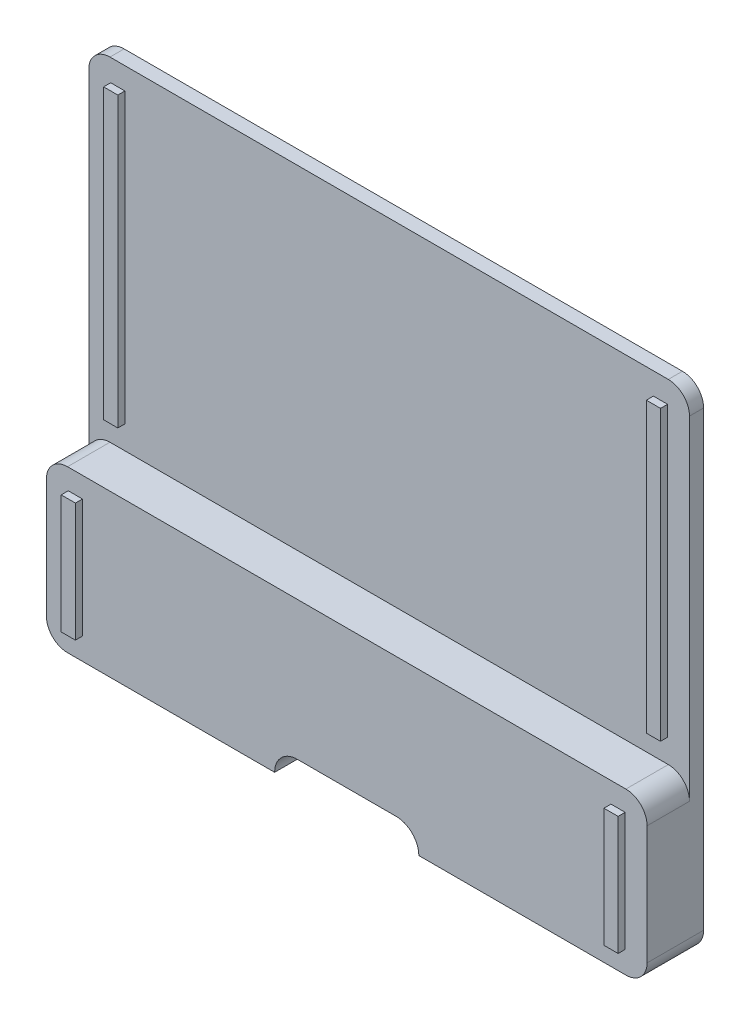
ISO-10303-21;
HEADER;
FILE_DESCRIPTION(('STEP AP214'),'2;1');
FILE_NAME('part.step','',(''),(''),'','','');
FILE_SCHEMA(('AUTOMOTIVE_DESIGN { 1 0 10303 214 1 1 1 1 }'));
ENDSEC;
DATA;
#1=APPLICATION_CONTEXT('core data for automotive mechanical design processes');
#2=APPLICATION_PROTOCOL_DEFINITION('international standard','automotive_design',2000,#1);
#3=PRODUCT_CONTEXT('',#1,'mechanical');
#4=PRODUCT('Part','Part','',(#3));
#5=PRODUCT_RELATED_PRODUCT_CATEGORY('part','',(#4));
#6=PRODUCT_DEFINITION_FORMATION('','',#4);
#7=PRODUCT_DEFINITION_CONTEXT('part definition',#1,'design');
#8=PRODUCT_DEFINITION('design','',#6,#7);
#9=PRODUCT_DEFINITION_SHAPE('','',#8);
#10=(LENGTH_UNIT() NAMED_UNIT(*) SI_UNIT(.MILLI.,.METRE.));
#11=(NAMED_UNIT(*) PLANE_ANGLE_UNIT() SI_UNIT($,.RADIAN.));
#12=(NAMED_UNIT(*) SI_UNIT($,.STERADIAN.) SOLID_ANGLE_UNIT());
#13=UNCERTAINTY_MEASURE_WITH_UNIT(LENGTH_MEASURE(1.E-05),#10,'distance_accuracy_value','');
#14=(GEOMETRIC_REPRESENTATION_CONTEXT(3) GLOBAL_UNCERTAINTY_ASSIGNED_CONTEXT((#13)) GLOBAL_UNIT_ASSIGNED_CONTEXT((#10,
#11,#12)) REPRESENTATION_CONTEXT('',''));
#15=CARTESIAN_POINT('',(0.,0.,0.));
#16=DIRECTION('',(0.,0.,1.));
#17=DIRECTION('',(1.,0.,0.));
#18=AXIS2_PLACEMENT_3D('',#15,#16,#17);
#19=CARTESIAN_POINT('',(82.0000000000004,66.9999999999988,2.));
#20=DIRECTION('',(0.,0.,-1.));
#21=DIRECTION('',(-1.,0.,0.));
#22=AXIS2_PLACEMENT_3D('',#19,#20,#21);
#23=PLANE('',#22);
#24=DIRECTION('',(0.,-1.,0.));
#25=VECTOR('',#24,1.);
#26=CARTESIAN_POINT('',(3.09999999999784,66.8999999999988,2.));
#27=LINE('',#26,#25);
#28=CARTESIAN_POINT('',(3.09999999999784,66.8999999999988,2.));
#29=VERTEX_POINT('',#28);
#30=CARTESIAN_POINT('',(3.09999999999784,26.0999999999973,2.));
#31=VERTEX_POINT('',#30);
#32=EDGE_CURVE('E274',#29,#31,#27,.T.);
#33=ORIENTED_EDGE('',*,*,#32,.F.);
#34=DIRECTION('',(-1.,0.,0.));
#35=VECTOR('',#34,1.);
#36=CARTESIAN_POINT('',(3.09999999999784,66.8999999999988,2.));
#37=LINE('',#36,#35);
#38=CARTESIAN_POINT('',(5.11,66.8999999999988,2.));
#39=VERTEX_POINT('',#38);
#40=EDGE_CURVE('E290',#39,#29,#37,.T.);
#41=ORIENTED_EDGE('',*,*,#40,.F.);
#42=DIRECTION('',(0.,1.,0.));
#43=VECTOR('',#42,1.);
#44=CARTESIAN_POINT('',(5.11,66.8999999999988,2.));
#45=LINE('',#44,#43);
#46=CARTESIAN_POINT('',(5.11,26.0999999999973,2.));
#47=VERTEX_POINT('',#46);
#48=EDGE_CURVE('E303',#47,#39,#45,.T.);
#49=ORIENTED_EDGE('',*,*,#48,.F.);
#50=DIRECTION('',(1.,0.,0.));
#51=VECTOR('',#50,1.);
#52=CARTESIAN_POINT('',(3.09999999999784,26.0999999999973,2.));
#53=LINE('',#52,#51);
#54=EDGE_CURVE('E279',#31,#47,#53,.T.);
#55=ORIENTED_EDGE('',*,*,#54,.F.);
#56=EDGE_LOOP('',(#33,#41,#49,#55));
#57=FACE_BOUND('',#56,.T.);
#58=CARTESIAN_POINT('',(82.0000000000007,66.9999999999988,2.));
#59=DIRECTION('',(0.,0.,-1.));
#60=DIRECTION('',(-1.,0.,0.));
#61=AXIS2_PLACEMENT_3D('',#58,#59,#60);
#62=CIRCLE('',#61,3.);
#63=CARTESIAN_POINT('',(85.0000000000007,66.9999999999988,2.));
#64=VERTEX_POINT('',#63);
#65=CARTESIAN_POINT('',(82.0000000000006,69.9999999999988,2.));
#66=VERTEX_POINT('',#65);
#67=EDGE_CURVE('E429',#64,#66,#62,.F.);
#68=ORIENTED_EDGE('',*,*,#67,.T.);
#69=DIRECTION('',(-1.,0.,0.));
#70=VECTOR('',#69,1.);
#71=CARTESIAN_POINT('',(3.00000000000062,69.9999999999988,2.));
#72=LINE('',#71,#70);
#73=CARTESIAN_POINT('',(3.00000000000062,69.9999999999988,2.));
#74=VERTEX_POINT('',#73);
#75=EDGE_CURVE('E419',#66,#74,#72,.T.);
#76=ORIENTED_EDGE('',*,*,#75,.T.);
#77=CARTESIAN_POINT('',(3.00000000000062,66.9999999999987,2.));
#78=DIRECTION('',(0.,0.,-1.));
#79=DIRECTION('',(-1.,0.,0.));
#80=AXIS2_PLACEMENT_3D('',#77,#78,#79);
#81=CIRCLE('',#80,3.00000000000008);
#82=CARTESIAN_POINT('',(5.39932681897781E-13,66.9999999999987,2.));
#83=VERTEX_POINT('',#82);
#84=EDGE_CURVE('E428',#74,#83,#81,.F.);
#85=ORIENTED_EDGE('',*,*,#84,.T.);
#86=DIRECTION('',(0.,-1.,0.));
#87=VECTOR('',#86,1.);
#88=CARTESIAN_POINT('',(5.42968447980741E-13,66.9999999999988,2.));
#89=LINE('',#88,#87);
#90=CARTESIAN_POINT('',(5.48748780872717E-13,19.7999999999962,2.));
#91=VERTEX_POINT('',#90);
#92=EDGE_CURVE('E452',#83,#91,#89,.T.);
#93=ORIENTED_EDGE('',*,*,#92,.T.);
#94=CARTESIAN_POINT('',(2.99999999999875,19.7999999999989,2.));
#95=DIRECTION('',(0.,0.,-1.));
#96=DIRECTION('',(-1.,0.,0.));
#97=AXIS2_PLACEMENT_3D('',#94,#95,#96);
#98=CIRCLE('',#97,2.9999999999984);
#99=CARTESIAN_POINT('',(2.99999999999875,22.7999999999973,2.));
#100=VERTEX_POINT('',#99);
#101=EDGE_CURVE('E447',#91,#100,#98,.T.);
#102=ORIENTED_EDGE('',*,*,#101,.T.);
#103=DIRECTION('',(1.,0.,0.));
#104=VECTOR('',#103,1.);
#105=CARTESIAN_POINT('',(2.99999999999875,22.7999999999974,2.));
#106=LINE('',#105,#104);
#107=CARTESIAN_POINT('',(81.9999999999994,22.7999999999974,2.));
#108=VERTEX_POINT('',#107);
#109=EDGE_CURVE('E442',#100,#108,#106,.T.);
#110=ORIENTED_EDGE('',*,*,#109,.T.);
#111=CARTESIAN_POINT('',(81.9999999999994,19.7999999999962,2.));
#112=DIRECTION('',(0.,0.,-1.));
#113=DIRECTION('',(-1.,0.,0.));
#114=AXIS2_PLACEMENT_3D('',#111,#112,#113);
#115=CIRCLE('',#114,3.00000000000124);
#116=CARTESIAN_POINT('',(85.0000000000007,19.7999999999962,2.));
#117=VERTEX_POINT('',#116);
#118=EDGE_CURVE('E437',#108,#117,#115,.T.);
#119=ORIENTED_EDGE('',*,*,#118,.T.);
#120=DIRECTION('',(0.,1.,0.));
#121=VECTOR('',#120,1.);
#122=CARTESIAN_POINT('',(85.0000000000007,66.9999999999988,2.));
#123=LINE('',#122,#121);
#124=EDGE_CURVE('E433',#117,#64,#123,.T.);
#125=ORIENTED_EDGE('',*,*,#124,.T.);
#126=EDGE_LOOP('',(#68,#76,#85,#93,#102,#110,#119,#125));
#127=FACE_BOUND('',#126,.T.);
#128=DIRECTION('',(0.,1.,0.));
#129=VECTOR('',#128,1.);
#130=CARTESIAN_POINT('',(81.9000000000007,66.8999999999988,2.));
#131=LINE('',#130,#129);
#132=CARTESIAN_POINT('',(81.9000000000007,26.0999999999973,2.));
#133=VERTEX_POINT('',#132);
#134=CARTESIAN_POINT('',(81.9000000000007,66.8999999999988,2.));
#135=VERTEX_POINT('',#134);
#136=EDGE_CURVE('E272',#133,#135,#131,.T.);
#137=ORIENTED_EDGE('',*,*,#136,.F.);
#138=DIRECTION('',(1.,0.,0.));
#139=VECTOR('',#138,1.);
#140=CARTESIAN_POINT('',(81.9000000000007,26.0999999999973,2.));
#141=LINE('',#140,#139);
#142=CARTESIAN_POINT('',(79.8900000000007,26.0999999999973,2.));
#143=VERTEX_POINT('',#142);
#144=EDGE_CURVE('E269',#143,#133,#141,.T.);
#145=ORIENTED_EDGE('',*,*,#144,.F.);
#146=DIRECTION('',(0.,-1.,0.));
#147=VECTOR('',#146,1.);
#148=CARTESIAN_POINT('',(79.8900000000007,66.8999999999988,2.));
#149=LINE('',#148,#147);
#150=CARTESIAN_POINT('',(79.8900000000007,66.8999999999988,2.));
#151=VERTEX_POINT('',#150);
#152=EDGE_CURVE('E62',#151,#143,#149,.T.);
#153=ORIENTED_EDGE('',*,*,#152,.F.);
#154=DIRECTION('',(-1.,0.,0.));
#155=VECTOR('',#154,1.);
#156=CARTESIAN_POINT('',(81.9000000000007,66.8999999999988,2.));
#157=LINE('',#156,#155);
#158=EDGE_CURVE('E57',#135,#151,#157,.T.);
#159=ORIENTED_EDGE('',*,*,#158,.F.);
#160=EDGE_LOOP('',(#137,#145,#153,#159));
#161=FACE_BOUND('',#160,.T.);
#162=ADVANCED_FACE('F41',(#57,#127,#161),#23,.F.);
#163=CARTESIAN_POINT('',(82.0000000000004,66.9999999999988,8.));
#164=DIRECTION('',(0.,0.,-1.));
#165=DIRECTION('',(-1.,0.,0.));
#166=AXIS2_PLACEMENT_3D('',#163,#164,#165);
#167=PLANE('',#166);
#168=DIRECTION('',(0.,-1.,0.));
#169=VECTOR('',#168,1.);
#170=CARTESIAN_POINT('',(3.1,3.1,8.));
#171=LINE('',#170,#169);
#172=CARTESIAN_POINT('',(3.1,19.8999999999989,8.));
#173=VERTEX_POINT('',#172);
#174=CARTESIAN_POINT('',(3.10000000000001,3.10000000000001,8.));
#175=VERTEX_POINT('',#174);
#176=EDGE_CURVE('E370',#173,#175,#171,.T.);
#177=ORIENTED_EDGE('',*,*,#176,.F.);
#178=DIRECTION('',(-1.,0.,0.));
#179=VECTOR('',#178,1.);
#180=CARTESIAN_POINT('',(3.1,19.8999999999989,8.));
#181=LINE('',#180,#179);
#182=CARTESIAN_POINT('',(5.11,19.8999999999989,8.));
#183=VERTEX_POINT('',#182);
#184=EDGE_CURVE('E376',#183,#173,#181,.T.);
#185=ORIENTED_EDGE('',*,*,#184,.F.);
#186=DIRECTION('',(0.,1.,0.));
#187=VECTOR('',#186,1.);
#188=CARTESIAN_POINT('',(5.11,3.1,8.));
#189=LINE('',#188,#187);
#190=CARTESIAN_POINT('',(5.11,3.10000000000001,8.));
#191=VERTEX_POINT('',#190);
#192=EDGE_CURVE('E393',#191,#183,#189,.T.);
#193=ORIENTED_EDGE('',*,*,#192,.F.);
#194=DIRECTION('',(1.,0.,0.));
#195=VECTOR('',#194,1.);
#196=CARTESIAN_POINT('',(3.1,3.1,8.));
#197=LINE('',#196,#195);
#198=EDGE_CURVE('E389',#175,#191,#197,.T.);
#199=ORIENTED_EDGE('',*,*,#198,.F.);
#200=EDGE_LOOP('',(#177,#185,#193,#199));
#201=FACE_BOUND('',#200,.T.);
#202=DIRECTION('',(1.,0.,0.));
#203=VECTOR('',#202,1.);
#204=CARTESIAN_POINT('',(2.99999999999875,22.7999999999974,8.));
#205=LINE('',#204,#203);
#206=CARTESIAN_POINT('',(2.99999999999875,22.7999999999973,8.));
#207=VERTEX_POINT('',#206);
#208=CARTESIAN_POINT('',(81.9999999999994,22.7999999999974,8.00000000000001));
#209=VERTEX_POINT('',#208);
#210=EDGE_CURVE('E420',#207,#209,#205,.T.);
#211=ORIENTED_EDGE('',*,*,#210,.F.);
#212=CARTESIAN_POINT('',(2.99999999999875,19.7999999999989,8.));
#213=DIRECTION('',(0.,0.,-1.));
#214=DIRECTION('',(1.,0.,0.));
#215=AXIS2_PLACEMENT_3D('',#212,#213,#214);
#216=CIRCLE('',#215,2.9999999999984);
#217=CARTESIAN_POINT('',(5.48748780872717E-13,19.7999999999962,8.));
#218=VERTEX_POINT('',#217);
#219=EDGE_CURVE('E415',#218,#207,#216,.T.);
#220=ORIENTED_EDGE('',*,*,#219,.F.);
#221=DIRECTION('',(0.,-1.,0.));
#222=VECTOR('',#221,1.);
#223=CARTESIAN_POINT('',(0.,66.9999999999988,8.));
#224=LINE('',#223,#222);
#225=CARTESIAN_POINT('',(0.,3.00000000000001,8.));
#226=VERTEX_POINT('',#225);
#227=EDGE_CURVE('E468',#218,#226,#224,.T.);
#228=ORIENTED_EDGE('',*,*,#227,.T.);
#229=CARTESIAN_POINT('',(3.00000000000001,3.00000000000001,8.));
#230=DIRECTION('',(0.,0.,1.));
#231=DIRECTION('',(1.,0.,0.));
#232=AXIS2_PLACEMENT_3D('',#229,#230,#231);
#233=CIRCLE('',#232,3.00000000000001);
#234=CARTESIAN_POINT('',(3.00000000000001,0.,8.));
#235=VERTEX_POINT('',#234);
#236=EDGE_CURVE('E471',#226,#235,#233,.T.);
#237=ORIENTED_EDGE('',*,*,#236,.T.);
#238=DIRECTION('',(1.,0.,0.));
#239=VECTOR('',#238,1.);
#240=CARTESIAN_POINT('',(3.00000000000001,0.,8.));
#241=LINE('',#240,#239);
#242=CARTESIAN_POINT('',(32.3000000000006,0.,8.));
#243=VERTEX_POINT('',#242);
#244=EDGE_CURVE('E475',#235,#243,#241,.T.);
#245=ORIENTED_EDGE('',*,*,#244,.T.);
#246=CARTESIAN_POINT('',(35.5000000000006,0.,8.));
#247=DIRECTION('',(0.,0.,-1.));
#248=DIRECTION('',(1.,0.,0.));
#249=AXIS2_PLACEMENT_3D('',#246,#247,#248);
#250=CIRCLE('',#249,3.20000000000001);
#251=CARTESIAN_POINT('',(35.5000000000006,3.20000000000001,8.));
#252=VERTEX_POINT('',#251);
#253=EDGE_CURVE('E478',#243,#252,#250,.T.);
#254=ORIENTED_EDGE('',*,*,#253,.T.);
#255=DIRECTION('',(1.,0.,0.));
#256=VECTOR('',#255,1.);
#257=CARTESIAN_POINT('',(35.5000000000006,3.20000000000001,8.));
#258=LINE('',#257,#256);
#259=CARTESIAN_POINT('',(49.5000000000006,3.20000000000001,8.));
#260=VERTEX_POINT('',#259);
#261=EDGE_CURVE('E481',#252,#260,#258,.T.);
#262=ORIENTED_EDGE('',*,*,#261,.T.);
#263=CARTESIAN_POINT('',(49.5000000000006,0.,8.));
#264=DIRECTION('',(0.,0.,-1.));
#265=DIRECTION('',(1.,0.,0.));
#266=AXIS2_PLACEMENT_3D('',#263,#264,#265);
#267=CIRCLE('',#266,3.20000000000001);
#268=CARTESIAN_POINT('',(52.7000000000006,0.,8.));
#269=VERTEX_POINT('',#268);
#270=EDGE_CURVE('E484',#260,#269,#267,.T.);
#271=ORIENTED_EDGE('',*,*,#270,.T.);
#272=DIRECTION('',(1.,0.,0.));
#273=VECTOR('',#272,1.);
#274=CARTESIAN_POINT('',(52.7000000000006,0.,8.));
#275=LINE('',#274,#273);
#276=CARTESIAN_POINT('',(82.0000000000007,0.,8.));
#277=VERTEX_POINT('',#276);
#278=EDGE_CURVE('E487',#269,#277,#275,.T.);
#279=ORIENTED_EDGE('',*,*,#278,.T.);
#280=CARTESIAN_POINT('',(82.0000000000007,3.00000000000001,8.));
#281=DIRECTION('',(0.,0.,1.));
#282=DIRECTION('',(1.,0.,0.));
#283=AXIS2_PLACEMENT_3D('',#280,#281,#282);
#284=CIRCLE('',#283,3.);
#285=CARTESIAN_POINT('',(85.0000000000007,3.00000000000001,8.));
#286=VERTEX_POINT('',#285);
#287=EDGE_CURVE('E490',#277,#286,#284,.T.);
#288=ORIENTED_EDGE('',*,*,#287,.T.);
#289=DIRECTION('',(0.,1.,0.));
#290=VECTOR('',#289,1.);
#291=CARTESIAN_POINT('',(85.0000000000004,66.9999999999988,8.));
#292=LINE('',#291,#290);
#293=CARTESIAN_POINT('',(85.0000000000007,19.7999999999962,8.));
#294=VERTEX_POINT('',#293);
#295=EDGE_CURVE('E493',#286,#294,#292,.T.);
#296=ORIENTED_EDGE('',*,*,#295,.T.);
#297=CARTESIAN_POINT('',(81.9999999999994,19.7999999999962,8.));
#298=DIRECTION('',(0.,0.,-1.));
#299=DIRECTION('',(1.,0.,0.));
#300=AXIS2_PLACEMENT_3D('',#297,#298,#299);
#301=CIRCLE('',#300,3.00000000000124);
#302=EDGE_CURVE('E416',#209,#294,#301,.T.);
#303=ORIENTED_EDGE('',*,*,#302,.F.);
#304=EDGE_LOOP('',(#211,#220,#228,#237,#245,#254,#262,#271,#279,#288,#296,#303));
#305=FACE_BOUND('',#304,.T.);
#306=DIRECTION('',(0.,1.,0.));
#307=VECTOR('',#306,1.);
#308=CARTESIAN_POINT('',(81.9000000000007,3.1,8.));
#309=LINE('',#308,#307);
#310=CARTESIAN_POINT('',(81.9000000000007,3.1,8.));
#311=VERTEX_POINT('',#310);
#312=CARTESIAN_POINT('',(81.9000000000007,19.8999999999989,8.));
#313=VERTEX_POINT('',#312);
#314=EDGE_CURVE('E325',#311,#313,#309,.T.);
#315=ORIENTED_EDGE('',*,*,#314,.F.);
#316=DIRECTION('',(1.,0.,0.));
#317=VECTOR('',#316,1.);
#318=CARTESIAN_POINT('',(81.9000000000007,3.1,8.));
#319=LINE('',#318,#317);
#320=CARTESIAN_POINT('',(79.8900000000007,3.1,8.));
#321=VERTEX_POINT('',#320);
#322=EDGE_CURVE('E331',#321,#311,#319,.T.);
#323=ORIENTED_EDGE('',*,*,#322,.F.);
#324=DIRECTION('',(0.,-1.,0.));
#325=VECTOR('',#324,1.);
#326=CARTESIAN_POINT('',(79.8900000000007,3.1,8.));
#327=LINE('',#326,#325);
#328=CARTESIAN_POINT('',(79.8900000000007,19.8999999999989,8.));
#329=VERTEX_POINT('',#328);
#330=EDGE_CURVE('E348',#329,#321,#327,.T.);
#331=ORIENTED_EDGE('',*,*,#330,.F.);
#332=DIRECTION('',(-1.,0.,0.));
#333=VECTOR('',#332,1.);
#334=CARTESIAN_POINT('',(81.9000000000007,19.8999999999989,8.));
#335=LINE('',#334,#333);
#336=EDGE_CURVE('E344',#313,#329,#335,.T.);
#337=ORIENTED_EDGE('',*,*,#336,.F.);
#338=EDGE_LOOP('',(#315,#323,#331,#337));
#339=FACE_BOUND('',#338,.T.);
#340=ADVANCED_FACE('F603',(#201,#305,#339),#167,.F.);
#341=CARTESIAN_POINT('',(82.0000000000004,66.9999999999988,8.));
#342=DIRECTION('',(0.,0.,-1.));
#343=DIRECTION('',(-1.,0.,0.));
#344=AXIS2_PLACEMENT_3D('',#341,#342,#343);
#345=CYLINDRICAL_SURFACE('',#344,3.);
#346=DIRECTION('',(0.,0.,-1.));
#347=VECTOR('',#346,1.);
#348=CARTESIAN_POINT('',(81.9999999999991,69.9999999999988,8.));
#349=LINE('',#348,#347);
#350=CARTESIAN_POINT('',(81.9999999999991,69.9999999999988,0.));
#351=VERTEX_POINT('',#350);
#352=EDGE_CURVE('E12',#66,#351,#349,.T.);
#353=ORIENTED_EDGE('',*,*,#352,.F.);
#354=ORIENTED_EDGE('',*,*,#67,.F.);
#355=DIRECTION('',(0.,0.,-1.));
#356=VECTOR('',#355,1.);
#357=CARTESIAN_POINT('',(85.0000000000004,66.9999999999988,8.));
#358=LINE('',#357,#356);
#359=CARTESIAN_POINT('',(85.0000000000004,66.9999999999988,0.));
#360=VERTEX_POINT('',#359);
#361=EDGE_CURVE('E497',#64,#360,#358,.T.);
#362=ORIENTED_EDGE('',*,*,#361,.T.);
#363=CARTESIAN_POINT('',(82.0000000000004,66.9999999999988,0.));
#364=DIRECTION('',(0.,0.,1.));
#365=DIRECTION('',(-1.,0.,0.));
#366=AXIS2_PLACEMENT_3D('',#363,#364,#365);
#367=CIRCLE('',#366,3.);
#368=EDGE_CURVE('E432',#360,#351,#367,.T.);
#369=ORIENTED_EDGE('',*,*,#368,.T.);
#370=EDGE_LOOP('',(#353,#354,#362,#369));
#371=FACE_BOUND('',#370,.T.);
#372=ADVANCED_FACE('F43',(#371),#345,.T.);
#373=CARTESIAN_POINT('',(2.99999999999913,69.9999999999988,8.));
#374=DIRECTION('',(0.,-1.,0.));
#375=DIRECTION('',(0.,0.,-1.));
#376=AXIS2_PLACEMENT_3D('',#373,#374,#375);
#377=PLANE('',#376);
#378=DIRECTION('',(0.,0.,-1.));
#379=VECTOR('',#378,1.);
#380=CARTESIAN_POINT('',(2.99999999999913,69.9999999999988,8.));
#381=LINE('',#380,#379);
#382=CARTESIAN_POINT('',(2.99999999999913,69.9999999999988,0.));
#383=VERTEX_POINT('',#382);
#384=EDGE_CURVE('E50',#74,#383,#381,.T.);
#385=ORIENTED_EDGE('',*,*,#384,.F.);
#386=ORIENTED_EDGE('',*,*,#75,.F.);
#387=ORIENTED_EDGE('',*,*,#352,.T.);
#388=DIRECTION('',(-1.,0.,0.));
#389=VECTOR('',#388,1.);
#390=CARTESIAN_POINT('',(2.99999999999913,69.9999999999988,0.));
#391=LINE('',#390,#389);
#392=EDGE_CURVE('E501',#351,#383,#391,.T.);
#393=ORIENTED_EDGE('',*,*,#392,.T.);
#394=EDGE_LOOP('',(#385,#386,#387,#393));
#395=FACE_BOUND('',#394,.T.);
#396=ADVANCED_FACE('F583',(#395),#377,.F.);
#397=CARTESIAN_POINT('',(3.00000000000032,66.9999999999988,8.));
#398=DIRECTION('',(0.,0.,-1.));
#399=DIRECTION('',(-1.,0.,0.));
#400=AXIS2_PLACEMENT_3D('',#397,#398,#399);
#401=CYLINDRICAL_SURFACE('',#400,3.00000000000016);
#402=DIRECTION('',(0.,0.,-1.));
#403=VECTOR('',#402,1.);
#404=CARTESIAN_POINT('',(1.58727198051878E-13,66.9999999999988,8.));
#405=LINE('',#404,#403);
#406=CARTESIAN_POINT('',(1.58727198051878E-13,66.9999999999988,0.));
#407=VERTEX_POINT('',#406);
#408=EDGE_CURVE('E570',#83,#407,#405,.T.);
#409=ORIENTED_EDGE('',*,*,#408,.F.);
#410=ORIENTED_EDGE('',*,*,#84,.F.);
#411=ORIENTED_EDGE('',*,*,#384,.T.);
#412=CARTESIAN_POINT('',(3.00000000000032,66.9999999999988,0.));
#413=DIRECTION('',(0.,0.,1.));
#414=DIRECTION('',(-1.,0.,0.));
#415=AXIS2_PLACEMENT_3D('',#412,#413,#414);
#416=CIRCLE('',#415,3.00000000000016);
#417=EDGE_CURVE('E505',#383,#407,#416,.T.);
#418=ORIENTED_EDGE('',*,*,#417,.T.);
#419=EDGE_LOOP('',(#409,#410,#411,#418));
#420=FACE_BOUND('',#419,.T.);
#421=ADVANCED_FACE('F577',(#420),#401,.T.);
#422=CARTESIAN_POINT('',(0.,66.9999999999988,8.));
#423=DIRECTION('',(1.,0.,0.));
#424=DIRECTION('',(0.,0.,-1.));
#425=AXIS2_PLACEMENT_3D('',#422,#423,#424);
#426=PLANE('',#425);
#427=DIRECTION('',(0.,0.,1.));
#428=VECTOR('',#427,1.);
#429=CARTESIAN_POINT('',(5.48748780872717E-13,19.7999999999962,-98.7169691593108));
#430=LINE('',#429,#428);
#431=EDGE_CURVE('E451',#91,#218,#430,.T.);
#432=ORIENTED_EDGE('',*,*,#431,.F.);
#433=ORIENTED_EDGE('',*,*,#92,.F.);
#434=ORIENTED_EDGE('',*,*,#408,.T.);
#435=DIRECTION('',(0.,-1.,0.));
#436=VECTOR('',#435,1.);
#437=CARTESIAN_POINT('',(0.,66.9999999999988,0.));
#438=LINE('',#437,#436);
#439=CARTESIAN_POINT('',(0.,3.00000000000001,0.));
#440=VERTEX_POINT('',#439);
#441=EDGE_CURVE('E509',#407,#440,#438,.T.);
#442=ORIENTED_EDGE('',*,*,#441,.T.);
#443=DIRECTION('',(0.,0.,-1.));
#444=VECTOR('',#443,1.);
#445=CARTESIAN_POINT('',(0.,3.00000000000001,8.));
#446=LINE('',#445,#444);
#447=EDGE_CURVE('E566',#226,#440,#446,.T.);
#448=ORIENTED_EDGE('',*,*,#447,.F.);
#449=ORIENTED_EDGE('',*,*,#227,.F.);
#450=EDGE_LOOP('',(#432,#433,#434,#442,#448,#449));
#451=FACE_BOUND('',#450,.T.);
#452=ADVANCED_FACE('F593',(#451),#426,.F.);
#453=CARTESIAN_POINT('',(3.00000000000001,3.00000000000001,8.));
#454=DIRECTION('',(0.,0.,-1.));
#455=DIRECTION('',(-1.,0.,0.));
#456=AXIS2_PLACEMENT_3D('',#453,#454,#455);
#457=CYLINDRICAL_SURFACE('',#456,3.00000000000001);
#458=CARTESIAN_POINT('',(3.00000000000001,3.00000000000001,0.));
#459=DIRECTION('',(0.,0.,1.));
#460=DIRECTION('',(1.,0.,0.));
#461=AXIS2_PLACEMENT_3D('',#458,#459,#460);
#462=CIRCLE('',#461,3.00000000000001);
#463=CARTESIAN_POINT('',(3.00000000000001,0.,0.));
#464=VERTEX_POINT('',#463);
#465=EDGE_CURVE('E512',#440,#464,#462,.T.);
#466=ORIENTED_EDGE('',*,*,#465,.T.);
#467=DIRECTION('',(0.,0.,-1.));
#468=VECTOR('',#467,1.);
#469=CARTESIAN_POINT('',(3.00000000000001,0.,8.));
#470=LINE('',#469,#468);
#471=EDGE_CURVE('E562',#235,#464,#470,.T.);
#472=ORIENTED_EDGE('',*,*,#471,.F.);
#473=ORIENTED_EDGE('',*,*,#236,.F.);
#474=ORIENTED_EDGE('',*,*,#447,.T.);
#475=EDGE_LOOP('',(#466,#472,#473,#474));
#476=FACE_BOUND('',#475,.T.);
#477=ADVANCED_FACE('F598',(#476),#457,.T.);
#478=CARTESIAN_POINT('',(3.00000000000001,0.,8.));
#479=DIRECTION('',(0.,1.,0.));
#480=DIRECTION('',(0.,0.,1.));
#481=AXIS2_PLACEMENT_3D('',#478,#479,#480);
#482=PLANE('',#481);
#483=DIRECTION('',(1.,0.,0.));
#484=VECTOR('',#483,1.);
#485=CARTESIAN_POINT('',(3.00000000000001,0.,0.));
#486=LINE('',#485,#484);
#487=CARTESIAN_POINT('',(32.3000000000006,0.,0.));
#488=VERTEX_POINT('',#487);
#489=EDGE_CURVE('E515',#464,#488,#486,.T.);
#490=ORIENTED_EDGE('',*,*,#489,.T.);
#491=DIRECTION('',(0.,0.,-1.));
#492=VECTOR('',#491,1.);
#493=CARTESIAN_POINT('',(32.3000000000006,0.,8.));
#494=LINE('',#493,#492);
#495=EDGE_CURVE('E558',#243,#488,#494,.T.);
#496=ORIENTED_EDGE('',*,*,#495,.F.);
#497=ORIENTED_EDGE('',*,*,#244,.F.);
#498=ORIENTED_EDGE('',*,*,#471,.T.);
#499=EDGE_LOOP('',(#490,#496,#497,#498));
#500=FACE_BOUND('',#499,.T.);
#501=ADVANCED_FACE('F645',(#500),#482,.F.);
#502=CARTESIAN_POINT('',(35.5000000000006,0.,8.));
#503=DIRECTION('',(0.,0.,-1.));
#504=DIRECTION('',(-1.,0.,0.));
#505=AXIS2_PLACEMENT_3D('',#502,#503,#504);
#506=CYLINDRICAL_SURFACE('',#505,3.20000000000001);
#507=CARTESIAN_POINT('',(35.5000000000006,0.,0.));
#508=DIRECTION('',(0.,0.,-1.));
#509=DIRECTION('',(1.,0.,0.));
#510=AXIS2_PLACEMENT_3D('',#507,#508,#509);
#511=CIRCLE('',#510,3.20000000000001);
#512=CARTESIAN_POINT('',(35.5000000000006,3.20000000000001,0.));
#513=VERTEX_POINT('',#512);
#514=EDGE_CURVE('E518',#488,#513,#511,.T.);
#515=ORIENTED_EDGE('',*,*,#514,.T.);
#516=DIRECTION('',(0.,0.,-1.));
#517=VECTOR('',#516,1.);
#518=CARTESIAN_POINT('',(35.5000000000006,3.20000000000001,8.));
#519=LINE('',#518,#517);
#520=EDGE_CURVE('E554',#252,#513,#519,.T.);
#521=ORIENTED_EDGE('',*,*,#520,.F.);
#522=ORIENTED_EDGE('',*,*,#253,.F.);
#523=ORIENTED_EDGE('',*,*,#495,.T.);
#524=EDGE_LOOP('',(#515,#521,#522,#523));
#525=FACE_BOUND('',#524,.T.);
#526=ADVANCED_FACE('F643',(#525),#506,.F.);
#527=CARTESIAN_POINT('',(35.5000000000006,3.20000000000001,8.));
#528=DIRECTION('',(0.,1.,0.));
#529=DIRECTION('',(0.,0.,1.));
#530=AXIS2_PLACEMENT_3D('',#527,#528,#529);
#531=PLANE('',#530);
#532=DIRECTION('',(1.,0.,0.));
#533=VECTOR('',#532,1.);
#534=CARTESIAN_POINT('',(35.5000000000006,3.20000000000001,0.));
#535=LINE('',#534,#533);
#536=CARTESIAN_POINT('',(49.5000000000006,3.20000000000001,0.));
#537=VERTEX_POINT('',#536);
#538=EDGE_CURVE('E521',#513,#537,#535,.T.);
#539=ORIENTED_EDGE('',*,*,#538,.T.);
#540=DIRECTION('',(0.,0.,-1.));
#541=VECTOR('',#540,1.);
#542=CARTESIAN_POINT('',(49.5000000000006,3.20000000000001,8.));
#543=LINE('',#542,#541);
#544=EDGE_CURVE('E550',#260,#537,#543,.T.);
#545=ORIENTED_EDGE('',*,*,#544,.F.);
#546=ORIENTED_EDGE('',*,*,#261,.F.);
#547=ORIENTED_EDGE('',*,*,#520,.T.);
#548=EDGE_LOOP('',(#539,#545,#546,#547));
#549=FACE_BOUND('',#548,.T.);
#550=ADVANCED_FACE('F639',(#549),#531,.F.);
#551=CARTESIAN_POINT('',(49.5000000000006,0.,8.));
#552=DIRECTION('',(0.,0.,-1.));
#553=DIRECTION('',(-1.,0.,0.));
#554=AXIS2_PLACEMENT_3D('',#551,#552,#553);
#555=CYLINDRICAL_SURFACE('',#554,3.20000000000001);
#556=CARTESIAN_POINT('',(49.5000000000006,0.,0.));
#557=DIRECTION('',(0.,0.,-1.));
#558=DIRECTION('',(1.,0.,0.));
#559=AXIS2_PLACEMENT_3D('',#556,#557,#558);
#560=CIRCLE('',#559,3.20000000000001);
#561=CARTESIAN_POINT('',(52.7000000000006,0.,0.));
#562=VERTEX_POINT('',#561);
#563=EDGE_CURVE('E524',#537,#562,#560,.T.);
#564=ORIENTED_EDGE('',*,*,#563,.T.);
#565=DIRECTION('',(0.,0.,-1.));
#566=VECTOR('',#565,1.);
#567=CARTESIAN_POINT('',(52.7000000000006,0.,8.));
#568=LINE('',#567,#566);
#569=EDGE_CURVE('E546',#269,#562,#568,.T.);
#570=ORIENTED_EDGE('',*,*,#569,.F.);
#571=ORIENTED_EDGE('',*,*,#270,.F.);
#572=ORIENTED_EDGE('',*,*,#544,.T.);
#573=EDGE_LOOP('',(#564,#570,#571,#572));
#574=FACE_BOUND('',#573,.T.);
#575=ADVANCED_FACE('F634',(#574),#555,.F.);
#576=CARTESIAN_POINT('',(52.7000000000006,0.,8.));
#577=DIRECTION('',(0.,1.,0.));
#578=DIRECTION('',(0.,0.,1.));
#579=AXIS2_PLACEMENT_3D('',#576,#577,#578);
#580=PLANE('',#579);
#581=DIRECTION('',(1.,0.,0.));
#582=VECTOR('',#581,1.);
#583=CARTESIAN_POINT('',(52.7000000000006,0.,0.));
#584=LINE('',#583,#582);
#585=CARTESIAN_POINT('',(82.0000000000007,0.,0.));
#586=VERTEX_POINT('',#585);
#587=EDGE_CURVE('E527',#562,#586,#584,.T.);
#588=ORIENTED_EDGE('',*,*,#587,.T.);
#589=DIRECTION('',(0.,0.,-1.));
#590=VECTOR('',#589,1.);
#591=CARTESIAN_POINT('',(82.0000000000007,0.,8.));
#592=LINE('',#591,#590);
#593=EDGE_CURVE('E542',#277,#586,#592,.T.);
#594=ORIENTED_EDGE('',*,*,#593,.F.);
#595=ORIENTED_EDGE('',*,*,#278,.F.);
#596=ORIENTED_EDGE('',*,*,#569,.T.);
#597=EDGE_LOOP('',(#588,#594,#595,#596));
#598=FACE_BOUND('',#597,.T.);
#599=ADVANCED_FACE('F628',(#598),#580,.F.);
#600=CARTESIAN_POINT('',(82.0000000000007,3.00000000000001,8.));
#601=DIRECTION('',(0.,0.,-1.));
#602=DIRECTION('',(-1.,0.,0.));
#603=AXIS2_PLACEMENT_3D('',#600,#601,#602);
#604=CYLINDRICAL_SURFACE('',#603,3.);
#605=CARTESIAN_POINT('',(82.0000000000007,3.00000000000001,0.));
#606=DIRECTION('',(0.,0.,1.));
#607=DIRECTION('',(1.,0.,0.));
#608=AXIS2_PLACEMENT_3D('',#605,#606,#607);
#609=CIRCLE('',#608,3.);
#610=CARTESIAN_POINT('',(85.0000000000007,3.00000000000001,0.));
#611=VERTEX_POINT('',#610);
#612=EDGE_CURVE('E530',#586,#611,#609,.T.);
#613=ORIENTED_EDGE('',*,*,#612,.T.);
#614=DIRECTION('',(0.,0.,-1.));
#615=VECTOR('',#614,1.);
#616=CARTESIAN_POINT('',(85.0000000000007,3.00000000000001,8.));
#617=LINE('',#616,#615);
#618=EDGE_CURVE('E538',#286,#611,#617,.T.);
#619=ORIENTED_EDGE('',*,*,#618,.F.);
#620=ORIENTED_EDGE('',*,*,#287,.F.);
#621=ORIENTED_EDGE('',*,*,#593,.T.);
#622=EDGE_LOOP('',(#613,#619,#620,#621));
#623=FACE_BOUND('',#622,.T.);
#624=ADVANCED_FACE('F624',(#623),#604,.T.);
#625=CARTESIAN_POINT('',(85.0000000000004,66.9999999999988,8.));
#626=DIRECTION('',(-1.,0.,0.));
#627=DIRECTION('',(0.,-1.,0.));
#628=AXIS2_PLACEMENT_3D('',#625,#626,#627);
#629=PLANE('',#628);
#630=ORIENTED_EDGE('',*,*,#361,.F.);
#631=ORIENTED_EDGE('',*,*,#124,.F.);
#632=DIRECTION('',(0.,0.,1.));
#633=VECTOR('',#632,1.);
#634=CARTESIAN_POINT('',(85.0000000000007,19.7999999999962,-98.7169691593108));
#635=LINE('',#634,#633);
#636=EDGE_CURVE('E436',#117,#294,#635,.T.);
#637=ORIENTED_EDGE('',*,*,#636,.T.);
#638=ORIENTED_EDGE('',*,*,#295,.F.);
#639=ORIENTED_EDGE('',*,*,#618,.T.);
#640=DIRECTION('',(0.,1.,0.));
#641=VECTOR('',#640,1.);
#642=CARTESIAN_POINT('',(85.0000000000004,66.9999999999988,0.));
#643=LINE('',#642,#641);
#644=EDGE_CURVE('E472',#611,#360,#643,.T.);
#645=ORIENTED_EDGE('',*,*,#644,.T.);
#646=EDGE_LOOP('',(#630,#631,#637,#638,#639,#645));
#647=FACE_BOUND('',#646,.T.);
#648=ADVANCED_FACE('F618',(#647),#629,.F.);
#649=CARTESIAN_POINT('',(82.0000000000004,66.9999999999988,0.));
#650=DIRECTION('',(0.,0.,-1.));
#651=DIRECTION('',(-1.,0.,0.));
#652=AXIS2_PLACEMENT_3D('',#649,#650,#651);
#653=PLANE('',#652);
#654=ORIENTED_EDGE('',*,*,#368,.F.);
#655=ORIENTED_EDGE('',*,*,#644,.F.);
#656=ORIENTED_EDGE('',*,*,#612,.F.);
#657=ORIENTED_EDGE('',*,*,#587,.F.);
#658=ORIENTED_EDGE('',*,*,#563,.F.);
#659=ORIENTED_EDGE('',*,*,#538,.F.);
#660=ORIENTED_EDGE('',*,*,#514,.F.);
#661=ORIENTED_EDGE('',*,*,#489,.F.);
#662=ORIENTED_EDGE('',*,*,#465,.F.);
#663=ORIENTED_EDGE('',*,*,#441,.F.);
#664=ORIENTED_EDGE('',*,*,#417,.F.);
#665=ORIENTED_EDGE('',*,*,#392,.F.);
#666=EDGE_LOOP('',(#654,#655,#656,#657,#658,#659,#660,#661,#662,#663,#664,#665));
#667=FACE_BOUND('',#666,.T.);
#668=ADVANCED_FACE('F587',(#667),#653,.T.);
#669=CARTESIAN_POINT('',(2.99999999999875,19.7999999999989,-98.7169691593108));
#670=DIRECTION('',(0.,0.,1.));
#671=DIRECTION('',(1.,0.,0.));
#672=AXIS2_PLACEMENT_3D('',#669,#670,#671);
#673=CYLINDRICAL_SURFACE('',#672,2.9999999999984);
#674=ORIENTED_EDGE('',*,*,#431,.T.);
#675=ORIENTED_EDGE('',*,*,#219,.T.);
#676=DIRECTION('',(0.,0.,1.));
#677=VECTOR('',#676,1.);
#678=CARTESIAN_POINT('',(2.99999999999875,22.7999999999973,-98.7169691593108));
#679=LINE('',#678,#677);
#680=EDGE_CURVE('E446',#100,#207,#679,.T.);
#681=ORIENTED_EDGE('',*,*,#680,.F.);
#682=ORIENTED_EDGE('',*,*,#101,.F.);
#683=EDGE_LOOP('',(#674,#675,#681,#682));
#684=FACE_BOUND('',#683,.T.);
#685=ADVANCED_FACE('F608',(#684),#673,.T.);
#686=CARTESIAN_POINT('',(2.99999999999875,22.7999999999974,-98.7169691593108));
#687=DIRECTION('',(0.,-1.,0.));
#688=DIRECTION('',(0.,0.,-1.));
#689=AXIS2_PLACEMENT_3D('',#686,#687,#688);
#690=PLANE('',#689);
#691=ORIENTED_EDGE('',*,*,#680,.T.);
#692=ORIENTED_EDGE('',*,*,#210,.T.);
#693=DIRECTION('',(0.,0.,1.));
#694=VECTOR('',#693,1.);
#695=CARTESIAN_POINT('',(81.9999999999994,22.7999999999974,-98.7169691593108));
#696=LINE('',#695,#694);
#697=EDGE_CURVE('E441',#108,#209,#696,.T.);
#698=ORIENTED_EDGE('',*,*,#697,.F.);
#699=ORIENTED_EDGE('',*,*,#109,.F.);
#700=EDGE_LOOP('',(#691,#692,#698,#699));
#701=FACE_BOUND('',#700,.T.);
#702=ADVANCED_FACE('F708',(#701),#690,.F.);
#703=CARTESIAN_POINT('',(81.9999999999994,19.7999999999962,-98.7169691593108));
#704=DIRECTION('',(0.,0.,1.));
#705=DIRECTION('',(1.,0.,0.));
#706=AXIS2_PLACEMENT_3D('',#703,#704,#705);
#707=CYLINDRICAL_SURFACE('',#706,3.00000000000124);
#708=ORIENTED_EDGE('',*,*,#697,.T.);
#709=ORIENTED_EDGE('',*,*,#302,.T.);
#710=ORIENTED_EDGE('',*,*,#636,.F.);
#711=ORIENTED_EDGE('',*,*,#118,.F.);
#712=EDGE_LOOP('',(#708,#709,#710,#711));
#713=FACE_BOUND('',#712,.T.);
#714=ADVANCED_FACE('F714',(#713),#707,.T.);
#715=CARTESIAN_POINT('',(3.1,3.1,9.));
#716=DIRECTION('',(1.,0.,0.));
#717=DIRECTION('',(0.,0.,-1.));
#718=AXIS2_PLACEMENT_3D('',#715,#716,#717);
#719=PLANE('',#718);
#720=ORIENTED_EDGE('',*,*,#176,.T.);
#721=DIRECTION('',(0.,0.,-1.));
#722=VECTOR('',#721,1.);
#723=CARTESIAN_POINT('',(3.1,3.1,9.));
#724=LINE('',#723,#722);
#725=CARTESIAN_POINT('',(3.1,3.1,9.));
#726=VERTEX_POINT('',#725);
#727=EDGE_CURVE('E411',#726,#175,#724,.T.);
#728=ORIENTED_EDGE('',*,*,#727,.F.);
#729=DIRECTION('',(0.,-1.,0.));
#730=VECTOR('',#729,1.);
#731=CARTESIAN_POINT('',(3.1,3.1,9.));
#732=LINE('',#731,#730);
#733=CARTESIAN_POINT('',(3.1,19.8999999999989,9.));
#734=VERTEX_POINT('',#733);
#735=EDGE_CURVE('E371',#734,#726,#732,.T.);
#736=ORIENTED_EDGE('',*,*,#735,.F.);
#737=DIRECTION('',(0.,0.,-1.));
#738=VECTOR('',#737,1.);
#739=CARTESIAN_POINT('',(3.1,19.8999999999989,9.));
#740=LINE('',#739,#738);
#741=EDGE_CURVE('E385',#734,#173,#740,.T.);
#742=ORIENTED_EDGE('',*,*,#741,.T.);
#743=EDGE_LOOP('',(#720,#728,#736,#742));
#744=FACE_BOUND('',#743,.T.);
#745=ADVANCED_FACE('F721',(#744),#719,.F.);
#746=CARTESIAN_POINT('',(3.1,3.1,9.));
#747=DIRECTION('',(0.,1.,0.));
#748=DIRECTION('',(0.,0.,1.));
#749=AXIS2_PLACEMENT_3D('',#746,#747,#748);
#750=PLANE('',#749);
#751=ORIENTED_EDGE('',*,*,#198,.T.);
#752=DIRECTION('',(0.,0.,-1.));
#753=VECTOR('',#752,1.);
#754=CARTESIAN_POINT('',(5.11,3.1,9.));
#755=LINE('',#754,#753);
#756=CARTESIAN_POINT('',(5.11,3.1,9.));
#757=VERTEX_POINT('',#756);
#758=EDGE_CURVE('E407',#757,#191,#755,.T.);
#759=ORIENTED_EDGE('',*,*,#758,.F.);
#760=DIRECTION('',(1.,0.,0.));
#761=VECTOR('',#760,1.);
#762=CARTESIAN_POINT('',(3.1,3.1,9.));
#763=LINE('',#762,#761);
#764=EDGE_CURVE('E375',#726,#757,#763,.T.);
#765=ORIENTED_EDGE('',*,*,#764,.F.);
#766=ORIENTED_EDGE('',*,*,#727,.T.);
#767=EDGE_LOOP('',(#751,#759,#765,#766));
#768=FACE_BOUND('',#767,.T.);
#769=ADVANCED_FACE('F730',(#768),#750,.F.);
#770=CARTESIAN_POINT('',(5.11,3.1,9.));
#771=DIRECTION('',(-1.,0.,0.));
#772=DIRECTION('',(0.,0.,1.));
#773=AXIS2_PLACEMENT_3D('',#770,#771,#772);
#774=PLANE('',#773);
#775=ORIENTED_EDGE('',*,*,#192,.T.);
#776=DIRECTION('',(0.,0.,-1.));
#777=VECTOR('',#776,1.);
#778=CARTESIAN_POINT('',(5.11,19.8999999999989,9.));
#779=LINE('',#778,#777);
#780=CARTESIAN_POINT('',(5.11,19.8999999999989,9.));
#781=VERTEX_POINT('',#780);
#782=EDGE_CURVE('E403',#781,#183,#779,.T.);
#783=ORIENTED_EDGE('',*,*,#782,.F.);
#784=DIRECTION('',(0.,1.,0.));
#785=VECTOR('',#784,1.);
#786=CARTESIAN_POINT('',(5.11,3.1,9.));
#787=LINE('',#786,#785);
#788=EDGE_CURVE('E379',#757,#781,#787,.T.);
#789=ORIENTED_EDGE('',*,*,#788,.F.);
#790=ORIENTED_EDGE('',*,*,#758,.T.);
#791=EDGE_LOOP('',(#775,#783,#789,#790));
#792=FACE_BOUND('',#791,.T.);
#793=ADVANCED_FACE('F738',(#792),#774,.F.);
#794=CARTESIAN_POINT('',(3.1,19.8999999999989,9.));
#795=DIRECTION('',(0.,-1.,0.));
#796=DIRECTION('',(0.,0.,-1.));
#797=AXIS2_PLACEMENT_3D('',#794,#795,#796);
#798=PLANE('',#797);
#799=ORIENTED_EDGE('',*,*,#184,.T.);
#800=ORIENTED_EDGE('',*,*,#741,.F.);
#801=DIRECTION('',(-1.,0.,0.));
#802=VECTOR('',#801,1.);
#803=CARTESIAN_POINT('',(3.1,19.8999999999989,9.));
#804=LINE('',#803,#802);
#805=EDGE_CURVE('E382',#781,#734,#804,.T.);
#806=ORIENTED_EDGE('',*,*,#805,.F.);
#807=ORIENTED_EDGE('',*,*,#782,.T.);
#808=EDGE_LOOP('',(#799,#800,#806,#807));
#809=FACE_BOUND('',#808,.T.);
#810=ADVANCED_FACE('F746',(#809),#798,.F.);
#811=CARTESIAN_POINT('',(0.,0.,9.));
#812=DIRECTION('',(0.,0.,-1.));
#813=DIRECTION('',(-1.,0.,0.));
#814=AXIS2_PLACEMENT_3D('',#811,#812,#813);
#815=PLANE('',#814);
#816=ORIENTED_EDGE('',*,*,#735,.T.);
#817=ORIENTED_EDGE('',*,*,#764,.T.);
#818=ORIENTED_EDGE('',*,*,#788,.T.);
#819=ORIENTED_EDGE('',*,*,#805,.T.);
#820=EDGE_LOOP('',(#816,#817,#818,#819));
#821=FACE_BOUND('',#820,.T.);
#822=ADVANCED_FACE('F754',(#821),#815,.F.);
#823=CARTESIAN_POINT('',(81.9000000000007,3.1,9.));
#824=DIRECTION('',(-1.,0.,0.));
#825=DIRECTION('',(0.,0.,1.));
#826=AXIS2_PLACEMENT_3D('',#823,#824,#825);
#827=PLANE('',#826);
#828=ORIENTED_EDGE('',*,*,#314,.T.);
#829=DIRECTION('',(0.,0.,-1.));
#830=VECTOR('',#829,1.);
#831=CARTESIAN_POINT('',(81.9000000000007,19.8999999999989,9.));
#832=LINE('',#831,#830);
#833=CARTESIAN_POINT('',(81.9000000000007,19.8999999999989,9.));
#834=VERTEX_POINT('',#833);
#835=EDGE_CURVE('E366',#834,#313,#832,.T.);
#836=ORIENTED_EDGE('',*,*,#835,.F.);
#837=DIRECTION('',(0.,1.,0.));
#838=VECTOR('',#837,1.);
#839=CARTESIAN_POINT('',(81.9000000000007,3.1,9.));
#840=LINE('',#839,#838);
#841=CARTESIAN_POINT('',(81.9000000000007,3.1,9.));
#842=VERTEX_POINT('',#841);
#843=EDGE_CURVE('E326',#842,#834,#840,.T.);
#844=ORIENTED_EDGE('',*,*,#843,.F.);
#845=DIRECTION('',(0.,0.,-1.));
#846=VECTOR('',#845,1.);
#847=CARTESIAN_POINT('',(81.9000000000007,3.1,9.));
#848=LINE('',#847,#846);
#849=EDGE_CURVE('E340',#842,#311,#848,.T.);
#850=ORIENTED_EDGE('',*,*,#849,.T.);
#851=EDGE_LOOP('',(#828,#836,#844,#850));
#852=FACE_BOUND('',#851,.T.);
#853=ADVANCED_FACE('F762',(#852),#827,.F.);
#854=CARTESIAN_POINT('',(81.9000000000007,19.8999999999989,9.));
#855=DIRECTION('',(0.,-1.,0.));
#856=DIRECTION('',(0.,0.,-1.));
#857=AXIS2_PLACEMENT_3D('',#854,#855,#856);
#858=PLANE('',#857);
#859=ORIENTED_EDGE('',*,*,#336,.T.);
#860=DIRECTION('',(0.,0.,-1.));
#861=VECTOR('',#860,1.);
#862=CARTESIAN_POINT('',(79.8900000000007,19.8999999999989,9.));
#863=LINE('',#862,#861);
#864=CARTESIAN_POINT('',(79.8900000000007,19.8999999999989,9.));
#865=VERTEX_POINT('',#864);
#866=EDGE_CURVE('E362',#865,#329,#863,.T.);
#867=ORIENTED_EDGE('',*,*,#866,.F.);
#868=DIRECTION('',(-1.,0.,0.));
#869=VECTOR('',#868,1.);
#870=CARTESIAN_POINT('',(81.9000000000007,19.8999999999989,9.));
#871=LINE('',#870,#869);
#872=EDGE_CURVE('E330',#834,#865,#871,.T.);
#873=ORIENTED_EDGE('',*,*,#872,.F.);
#874=ORIENTED_EDGE('',*,*,#835,.T.);
#875=EDGE_LOOP('',(#859,#867,#873,#874));
#876=FACE_BOUND('',#875,.T.);
#877=ADVANCED_FACE('F770',(#876),#858,.F.);
#878=CARTESIAN_POINT('',(79.8900000000007,3.1,9.));
#879=DIRECTION('',(1.,0.,0.));
#880=DIRECTION('',(0.,0.,-1.));
#881=AXIS2_PLACEMENT_3D('',#878,#879,#880);
#882=PLANE('',#881);
#883=ORIENTED_EDGE('',*,*,#330,.T.);
#884=DIRECTION('',(0.,0.,-1.));
#885=VECTOR('',#884,1.);
#886=CARTESIAN_POINT('',(79.8900000000007,3.1,9.));
#887=LINE('',#886,#885);
#888=CARTESIAN_POINT('',(79.8900000000007,3.1,9.));
#889=VERTEX_POINT('',#888);
#890=EDGE_CURVE('E358',#889,#321,#887,.T.);
#891=ORIENTED_EDGE('',*,*,#890,.F.);
#892=DIRECTION('',(0.,-1.,0.));
#893=VECTOR('',#892,1.);
#894=CARTESIAN_POINT('',(79.8900000000007,3.1,9.));
#895=LINE('',#894,#893);
#896=EDGE_CURVE('E334',#865,#889,#895,.T.);
#897=ORIENTED_EDGE('',*,*,#896,.F.);
#898=ORIENTED_EDGE('',*,*,#866,.T.);
#899=EDGE_LOOP('',(#883,#891,#897,#898));
#900=FACE_BOUND('',#899,.T.);
#901=ADVANCED_FACE('F778',(#900),#882,.F.);
#902=CARTESIAN_POINT('',(81.9000000000007,3.1,9.));
#903=DIRECTION('',(0.,1.,0.));
#904=DIRECTION('',(-1.,0.,0.));
#905=AXIS2_PLACEMENT_3D('',#902,#903,#904);
#906=PLANE('',#905);
#907=ORIENTED_EDGE('',*,*,#322,.T.);
#908=ORIENTED_EDGE('',*,*,#849,.F.);
#909=DIRECTION('',(1.,0.,0.));
#910=VECTOR('',#909,1.);
#911=CARTESIAN_POINT('',(81.9000000000007,3.1,9.));
#912=LINE('',#911,#910);
#913=EDGE_CURVE('E337',#889,#842,#912,.T.);
#914=ORIENTED_EDGE('',*,*,#913,.F.);
#915=ORIENTED_EDGE('',*,*,#890,.T.);
#916=EDGE_LOOP('',(#907,#908,#914,#915));
#917=FACE_BOUND('',#916,.T.);
#918=ADVANCED_FACE('F786',(#917),#906,.F.);
#919=CARTESIAN_POINT('',(0.,0.,9.));
#920=DIRECTION('',(0.,0.,1.));
#921=DIRECTION('',(1.,0.,0.));
#922=AXIS2_PLACEMENT_3D('',#919,#920,#921);
#923=PLANE('',#922);
#924=ORIENTED_EDGE('',*,*,#843,.T.);
#925=ORIENTED_EDGE('',*,*,#872,.T.);
#926=ORIENTED_EDGE('',*,*,#896,.T.);
#927=ORIENTED_EDGE('',*,*,#913,.T.);
#928=EDGE_LOOP('',(#924,#925,#926,#927));
#929=FACE_BOUND('',#928,.T.);
#930=ADVANCED_FACE('F794',(#929),#923,.T.);
#931=CARTESIAN_POINT('',(3.09999999999784,66.8999999999988,3.));
#932=DIRECTION('',(1.,0.,0.));
#933=DIRECTION('',(0.,0.,-1.));
#934=AXIS2_PLACEMENT_3D('',#931,#932,#933);
#935=PLANE('',#934);
#936=ORIENTED_EDGE('',*,*,#32,.T.);
#937=DIRECTION('',(0.,0.,-1.));
#938=VECTOR('',#937,1.);
#939=CARTESIAN_POINT('',(3.09999999999784,26.0999999999973,3.));
#940=LINE('',#939,#938);
#941=CARTESIAN_POINT('',(3.09999999999784,26.0999999999973,3.));
#942=VERTEX_POINT('',#941);
#943=EDGE_CURVE('E321',#942,#31,#940,.T.);
#944=ORIENTED_EDGE('',*,*,#943,.F.);
#945=DIRECTION('',(0.,-1.,0.));
#946=VECTOR('',#945,1.);
#947=CARTESIAN_POINT('',(3.09999999999784,66.8999999999988,3.));
#948=LINE('',#947,#946);
#949=CARTESIAN_POINT('',(3.09999999999784,66.8999999999988,3.));
#950=VERTEX_POINT('',#949);
#951=EDGE_CURVE('E285',#950,#942,#948,.T.);
#952=ORIENTED_EDGE('',*,*,#951,.F.);
#953=DIRECTION('',(0.,0.,-1.));
#954=VECTOR('',#953,1.);
#955=CARTESIAN_POINT('',(3.09999999999784,66.8999999999988,3.));
#956=LINE('',#955,#954);
#957=EDGE_CURVE('E298',#950,#29,#956,.T.);
#958=ORIENTED_EDGE('',*,*,#957,.T.);
#959=EDGE_LOOP('',(#936,#944,#952,#958));
#960=FACE_BOUND('',#959,.T.);
#961=ADVANCED_FACE('F802',(#960),#935,.F.);
#962=CARTESIAN_POINT('',(3.09999999999784,26.0999999999973,3.));
#963=DIRECTION('',(0.,1.,0.));
#964=DIRECTION('',(0.,0.,1.));
#965=AXIS2_PLACEMENT_3D('',#962,#963,#964);
#966=PLANE('',#965);
#967=ORIENTED_EDGE('',*,*,#54,.T.);
#968=DIRECTION('',(0.,0.,-1.));
#969=VECTOR('',#968,1.);
#970=CARTESIAN_POINT('',(5.11,26.0999999999973,3.));
#971=LINE('',#970,#969);
#972=CARTESIAN_POINT('',(5.11,26.0999999999973,3.));
#973=VERTEX_POINT('',#972);
#974=EDGE_CURVE('E317',#973,#47,#971,.T.);
#975=ORIENTED_EDGE('',*,*,#974,.F.);
#976=DIRECTION('',(1.,0.,0.));
#977=VECTOR('',#976,1.);
#978=CARTESIAN_POINT('',(3.09999999999784,26.0999999999973,3.));
#979=LINE('',#978,#977);
#980=EDGE_CURVE('E289',#942,#973,#979,.T.);
#981=ORIENTED_EDGE('',*,*,#980,.F.);
#982=ORIENTED_EDGE('',*,*,#943,.T.);
#983=EDGE_LOOP('',(#967,#975,#981,#982));
#984=FACE_BOUND('',#983,.T.);
#985=ADVANCED_FACE('F810',(#984),#966,.F.);
#986=CARTESIAN_POINT('',(5.11,66.8999999999988,3.));
#987=DIRECTION('',(-1.,0.,0.));
#988=DIRECTION('',(0.,0.,1.));
#989=AXIS2_PLACEMENT_3D('',#986,#987,#988);
#990=PLANE('',#989);
#991=ORIENTED_EDGE('',*,*,#48,.T.);
#992=DIRECTION('',(0.,0.,-1.));
#993=VECTOR('',#992,1.);
#994=CARTESIAN_POINT('',(5.11,66.8999999999988,3.));
#995=LINE('',#994,#993);
#996=CARTESIAN_POINT('',(5.11,66.8999999999988,3.));
#997=VERTEX_POINT('',#996);
#998=EDGE_CURVE('E313',#997,#39,#995,.T.);
#999=ORIENTED_EDGE('',*,*,#998,.F.);
#1000=DIRECTION('',(0.,1.,0.));
#1001=VECTOR('',#1000,1.);
#1002=CARTESIAN_POINT('',(5.11,66.8999999999988,3.));
#1003=LINE('',#1002,#1001);
#1004=EDGE_CURVE('E293',#973,#997,#1003,.T.);
#1005=ORIENTED_EDGE('',*,*,#1004,.F.);
#1006=ORIENTED_EDGE('',*,*,#974,.T.);
#1007=EDGE_LOOP('',(#991,#999,#1005,#1006));
#1008=FACE_BOUND('',#1007,.T.);
#1009=ADVANCED_FACE('F818',(#1008),#990,.F.);
#1010=CARTESIAN_POINT('',(3.09999999999784,66.8999999999988,3.));
#1011=DIRECTION('',(0.,-1.,0.));
#1012=DIRECTION('',(0.,0.,-1.));
#1013=AXIS2_PLACEMENT_3D('',#1010,#1011,#1012);
#1014=PLANE('',#1013);
#1015=ORIENTED_EDGE('',*,*,#40,.T.);
#1016=ORIENTED_EDGE('',*,*,#957,.F.);
#1017=DIRECTION('',(-1.,0.,0.));
#1018=VECTOR('',#1017,1.);
#1019=CARTESIAN_POINT('',(3.09999999999784,66.8999999999988,3.));
#1020=LINE('',#1019,#1018);
#1021=EDGE_CURVE('E296',#997,#950,#1020,.T.);
#1022=ORIENTED_EDGE('',*,*,#1021,.F.);
#1023=ORIENTED_EDGE('',*,*,#998,.T.);
#1024=EDGE_LOOP('',(#1015,#1016,#1022,#1023));
#1025=FACE_BOUND('',#1024,.T.);
#1026=ADVANCED_FACE('F826',(#1025),#1014,.F.);
#1027=CARTESIAN_POINT('',(0.,0.,3.));
#1028=DIRECTION('',(0.,0.,1.));
#1029=DIRECTION('',(1.,0.,0.));
#1030=AXIS2_PLACEMENT_3D('',#1027,#1028,#1029);
#1031=PLANE('',#1030);
#1032=ORIENTED_EDGE('',*,*,#951,.T.);
#1033=ORIENTED_EDGE('',*,*,#980,.T.);
#1034=ORIENTED_EDGE('',*,*,#1004,.T.);
#1035=ORIENTED_EDGE('',*,*,#1021,.T.);
#1036=EDGE_LOOP('',(#1032,#1033,#1034,#1035));
#1037=FACE_BOUND('',#1036,.T.);
#1038=ADVANCED_FACE('F834',(#1037),#1031,.T.);
#1039=CARTESIAN_POINT('',(81.9000000000007,66.8999999999988,3.));
#1040=DIRECTION('',(-1.,0.,0.));
#1041=DIRECTION('',(0.,0.,1.));
#1042=AXIS2_PLACEMENT_3D('',#1039,#1040,#1041);
#1043=PLANE('',#1042);
#1044=ORIENTED_EDGE('',*,*,#136,.T.);
#1045=DIRECTION('',(0.,0.,-1.));
#1046=VECTOR('',#1045,1.);
#1047=CARTESIAN_POINT('',(81.9000000000007,66.8999999999988,3.));
#1048=LINE('',#1047,#1046);
#1049=CARTESIAN_POINT('',(81.9000000000007,66.8999999999988,3.));
#1050=VERTEX_POINT('',#1049);
#1051=EDGE_CURVE('E251',#1050,#135,#1048,.T.);
#1052=ORIENTED_EDGE('',*,*,#1051,.F.);
#1053=DIRECTION('',(0.,1.,0.));
#1054=VECTOR('',#1053,1.);
#1055=CARTESIAN_POINT('',(81.9000000000007,66.8999999999988,3.));
#1056=LINE('',#1055,#1054);
#1057=CARTESIAN_POINT('',(81.9000000000007,26.0999999999973,3.));
#1058=VERTEX_POINT('',#1057);
#1059=EDGE_CURVE('E259',#1058,#1050,#1056,.T.);
#1060=ORIENTED_EDGE('',*,*,#1059,.F.);
#1061=DIRECTION('',(0.,0.,-1.));
#1062=VECTOR('',#1061,1.);
#1063=CARTESIAN_POINT('',(81.9000000000007,26.0999999999973,3.));
#1064=LINE('',#1063,#1062);
#1065=EDGE_CURVE('E990',#1058,#133,#1064,.T.);
#1066=ORIENTED_EDGE('',*,*,#1065,.T.);
#1067=EDGE_LOOP('',(#1044,#1052,#1060,#1066));
#1068=FACE_BOUND('',#1067,.T.);
#1069=ADVANCED_FACE('F271',(#1068),#1043,.F.);
#1070=CARTESIAN_POINT('',(81.9000000000007,66.8999999999988,3.));
#1071=DIRECTION('',(0.,-1.,0.));
#1072=DIRECTION('',(0.,0.,-1.));
#1073=AXIS2_PLACEMENT_3D('',#1070,#1071,#1072);
#1074=PLANE('',#1073);
#1075=ORIENTED_EDGE('',*,*,#158,.T.);
#1076=DIRECTION('',(0.,0.,-1.));
#1077=VECTOR('',#1076,1.);
#1078=CARTESIAN_POINT('',(79.8900000000007,66.8999999999988,3.));
#1079=LINE('',#1078,#1077);
#1080=CARTESIAN_POINT('',(79.8900000000007,66.8999999999988,3.));
#1081=VERTEX_POINT('',#1080);
#1082=EDGE_CURVE('E254',#1081,#151,#1079,.T.);
#1083=ORIENTED_EDGE('',*,*,#1082,.F.);
#1084=DIRECTION('',(-1.,0.,0.));
#1085=VECTOR('',#1084,1.);
#1086=CARTESIAN_POINT('',(81.9000000000007,66.8999999999988,3.));
#1087=LINE('',#1086,#1085);
#1088=EDGE_CURVE('E247',#1050,#1081,#1087,.T.);
#1089=ORIENTED_EDGE('',*,*,#1088,.F.);
#1090=ORIENTED_EDGE('',*,*,#1051,.T.);
#1091=EDGE_LOOP('',(#1075,#1083,#1089,#1090));
#1092=FACE_BOUND('',#1091,.T.);
#1093=ADVANCED_FACE('F249',(#1092),#1074,.F.);
#1094=CARTESIAN_POINT('',(79.8900000000007,66.8999999999988,3.));
#1095=DIRECTION('',(1.,0.,0.));
#1096=DIRECTION('',(0.,0.,-1.));
#1097=AXIS2_PLACEMENT_3D('',#1094,#1095,#1096);
#1098=PLANE('',#1097);
#1099=ORIENTED_EDGE('',*,*,#152,.T.);
#1100=DIRECTION('',(0.,0.,-1.));
#1101=VECTOR('',#1100,1.);
#1102=CARTESIAN_POINT('',(79.8900000000007,26.0999999999973,3.));
#1103=LINE('',#1102,#1101);
#1104=CARTESIAN_POINT('',(79.8900000000007,26.0999999999973,3.));
#1105=VERTEX_POINT('',#1104);
#1106=EDGE_CURVE('E281',#1105,#143,#1103,.T.);
#1107=ORIENTED_EDGE('',*,*,#1106,.F.);
#1108=DIRECTION('',(0.,-1.,0.));
#1109=VECTOR('',#1108,1.);
#1110=CARTESIAN_POINT('',(79.8900000000007,66.8999999999988,3.));
#1111=LINE('',#1110,#1109);
#1112=EDGE_CURVE('E258',#1081,#1105,#1111,.T.);
#1113=ORIENTED_EDGE('',*,*,#1112,.F.);
#1114=ORIENTED_EDGE('',*,*,#1082,.T.);
#1115=EDGE_LOOP('',(#1099,#1107,#1113,#1114));
#1116=FACE_BOUND('',#1115,.T.);
#1117=ADVANCED_FACE('F855',(#1116),#1098,.F.);
#1118=CARTESIAN_POINT('',(81.9000000000007,26.0999999999973,3.));
#1119=DIRECTION('',(0.,1.,0.));
#1120=DIRECTION('',(0.,0.,1.));
#1121=AXIS2_PLACEMENT_3D('',#1118,#1119,#1120);
#1122=PLANE('',#1121);
#1123=ORIENTED_EDGE('',*,*,#144,.T.);
#1124=ORIENTED_EDGE('',*,*,#1065,.F.);
#1125=DIRECTION('',(1.,0.,0.));
#1126=VECTOR('',#1125,1.);
#1127=CARTESIAN_POINT('',(81.9000000000007,26.0999999999973,3.));
#1128=LINE('',#1127,#1126);
#1129=EDGE_CURVE('E264',#1105,#1058,#1128,.T.);
#1130=ORIENTED_EDGE('',*,*,#1129,.F.);
#1131=ORIENTED_EDGE('',*,*,#1106,.T.);
#1132=EDGE_LOOP('',(#1123,#1124,#1130,#1131));
#1133=FACE_BOUND('',#1132,.T.);
#1134=ADVANCED_FACE('F862',(#1133),#1122,.F.);
#1135=CARTESIAN_POINT('',(0.,0.,3.));
#1136=DIRECTION('',(0.,0.,-1.));
#1137=DIRECTION('',(-1.,0.,0.));
#1138=AXIS2_PLACEMENT_3D('',#1135,#1136,#1137);
#1139=PLANE('',#1138);
#1140=ORIENTED_EDGE('',*,*,#1059,.T.);
#1141=ORIENTED_EDGE('',*,*,#1088,.T.);
#1142=ORIENTED_EDGE('',*,*,#1112,.T.);
#1143=ORIENTED_EDGE('',*,*,#1129,.T.);
#1144=EDGE_LOOP('',(#1140,#1141,#1142,#1143));
#1145=FACE_BOUND('',#1144,.T.);
#1146=ADVANCED_FACE('F262',(#1145),#1139,.F.);
#1147=CLOSED_SHELL('',(#162,#340,#372,#396,#421,#452,#477,#501,#526,#550,#575,#599,#624,#648,
#668,#685,#702,#714,#745,#769,#793,#810,#822,#853,#877,#901,#918,#930,#961,#985,#1009,#1026,
#1038,#1069,#1093,#1117,#1134,#1146));
#1148=MANIFOLD_SOLID_BREP('B2',#1147);
#1149=ADVANCED_BREP_SHAPE_REPRESENTATION('',(#18,#1148),#14);
#1150=SHAPE_DEFINITION_REPRESENTATION(#9,#1149);
ENDSEC;
END-ISO-10303-21;
